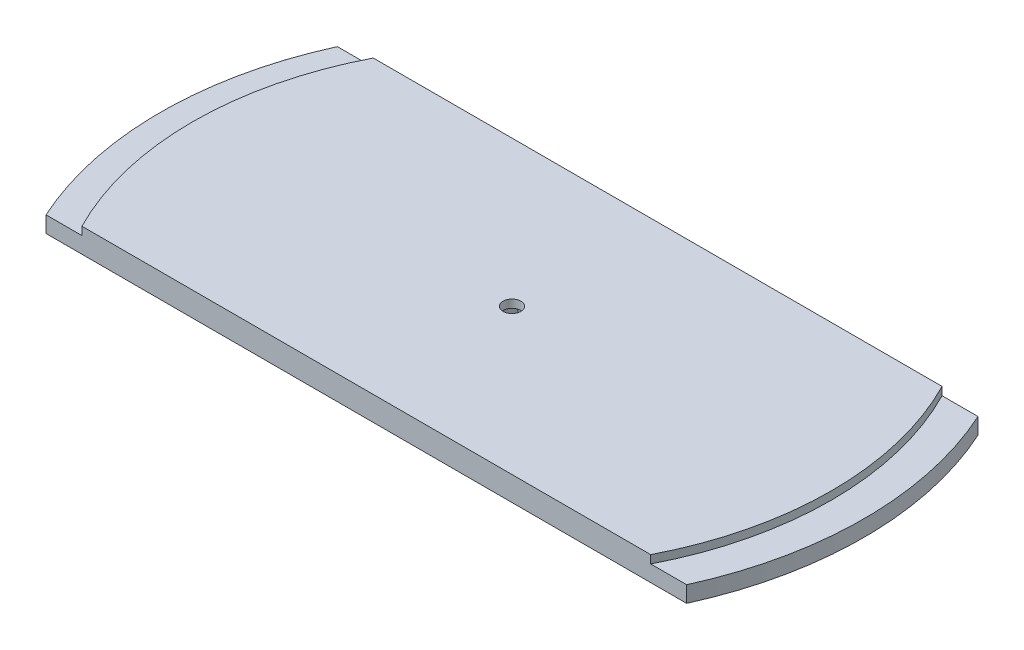
ISO-10303-21;
HEADER;
FILE_DESCRIPTION(('STEP AP214'),'2;1');
FILE_NAME('part.step','',(''),(''),'','','');
FILE_SCHEMA(('AUTOMOTIVE_DESIGN { 1 0 10303 214 1 1 1 1 }'));
ENDSEC;
DATA;
#1=APPLICATION_CONTEXT('core data for automotive mechanical design processes');
#2=APPLICATION_PROTOCOL_DEFINITION('international standard','automotive_design',2000,#1);
#3=PRODUCT_CONTEXT('',#1,'mechanical');
#4=PRODUCT('Part','Part','',(#3));
#5=PRODUCT_RELATED_PRODUCT_CATEGORY('part','',(#4));
#6=PRODUCT_DEFINITION_FORMATION('','',#4);
#7=PRODUCT_DEFINITION_CONTEXT('part definition',#1,'design');
#8=PRODUCT_DEFINITION('design','',#6,#7);
#9=PRODUCT_DEFINITION_SHAPE('','',#8);
#10=(LENGTH_UNIT() NAMED_UNIT(*) SI_UNIT(.MILLI.,.METRE.));
#11=(NAMED_UNIT(*) PLANE_ANGLE_UNIT() SI_UNIT($,.RADIAN.));
#12=(NAMED_UNIT(*) SI_UNIT($,.STERADIAN.) SOLID_ANGLE_UNIT());
#13=UNCERTAINTY_MEASURE_WITH_UNIT(LENGTH_MEASURE(1.E-05),#10,'distance_accuracy_value','');
#14=(GEOMETRIC_REPRESENTATION_CONTEXT(3) GLOBAL_UNCERTAINTY_ASSIGNED_CONTEXT((#13)) GLOBAL_UNIT_ASSIGNED_CONTEXT((#10,
#11,#12)) REPRESENTATION_CONTEXT('',''));
#15=CARTESIAN_POINT('',(0.,0.,0.));
#16=DIRECTION('',(0.,0.,1.));
#17=DIRECTION('',(1.,0.,0.));
#18=AXIS2_PLACEMENT_3D('',#15,#16,#17);
#19=CARTESIAN_POINT('',(-4.94933518262807,9.525,-2.8575));
#20=DIRECTION('',(0.866025403784439,0.,0.5));
#21=DIRECTION('',(0.5,0.,-0.866025403784438));
#22=AXIS2_PLACEMENT_3D('',#19,#20,#21);
#23=PLANE('',#22);
#24=DIRECTION('',(0.,-1.,0.));
#25=VECTOR('',#24,1.);
#26=CARTESIAN_POINT('',(-3.29955678841871,9.525,-5.71500000000001));
#27=LINE('',#26,#25);
#28=CARTESIAN_POINT('',(-3.29955678841871,6.35,-5.71500000000001));
#29=VERTEX_POINT('',#28);
#30=CARTESIAN_POINT('',(-3.29955678841871,0.,-5.71500000000001));
#31=VERTEX_POINT('',#30);
#32=EDGE_CURVE('E48',#29,#31,#27,.T.);
#33=ORIENTED_EDGE('',*,*,#32,.F.);
#34=DIRECTION('',(-0.5,0.,0.866025403784439));
#35=VECTOR('',#34,1.);
#36=CARTESIAN_POINT('',(-4.94933518262807,6.35,-2.8575));
#37=LINE('',#36,#35);
#38=CARTESIAN_POINT('',(-6.59911357683742,6.35,0.));
#39=VERTEX_POINT('',#38);
#40=EDGE_CURVE('E145',#29,#39,#37,.T.);
#41=ORIENTED_EDGE('',*,*,#40,.T.);
#42=DIRECTION('',(0.,-1.,0.));
#43=VECTOR('',#42,1.);
#44=CARTESIAN_POINT('',(-6.59911357683742,9.525,0.));
#45=LINE('',#44,#43);
#46=CARTESIAN_POINT('',(-6.59911357683742,0.,0.));
#47=VERTEX_POINT('',#46);
#48=EDGE_CURVE('E186',#39,#47,#45,.T.);
#49=ORIENTED_EDGE('',*,*,#48,.T.);
#50=DIRECTION('',(-0.5,0.,0.866025403784439));
#51=VECTOR('',#50,1.);
#52=CARTESIAN_POINT('',(-4.94933518262807,0.,-2.8575));
#53=LINE('',#52,#51);
#54=EDGE_CURVE('E166',#31,#47,#53,.T.);
#55=ORIENTED_EDGE('',*,*,#54,.F.);
#56=EDGE_LOOP('',(#33,#41,#49,#55));
#57=FACE_BOUND('',#56,.T.);
#58=ADVANCED_FACE('F45',(#57),#23,.T.);
#59=CARTESIAN_POINT('',(0.,9.525,-5.715));
#60=DIRECTION('',(0.,0.,1.));
#61=DIRECTION('',(1.,0.,0.));
#62=AXIS2_PLACEMENT_3D('',#59,#60,#61);
#63=PLANE('',#62);
#64=DIRECTION('',(0.,-1.,0.));
#65=VECTOR('',#64,1.);
#66=CARTESIAN_POINT('',(3.2995567884187,9.525,-5.715));
#67=LINE('',#66,#65);
#68=CARTESIAN_POINT('',(3.2995567884187,6.35,-5.715));
#69=VERTEX_POINT('',#68);
#70=CARTESIAN_POINT('',(3.2995567884187,0.,-5.715));
#71=VERTEX_POINT('',#70);
#72=EDGE_CURVE('E161',#69,#71,#67,.T.);
#73=ORIENTED_EDGE('',*,*,#72,.F.);
#74=DIRECTION('',(-1.,0.,0.));
#75=VECTOR('',#74,1.);
#76=CARTESIAN_POINT('',(0.,6.35,-5.715));
#77=LINE('',#76,#75);
#78=EDGE_CURVE('E148',#69,#29,#77,.T.);
#79=ORIENTED_EDGE('',*,*,#78,.T.);
#80=ORIENTED_EDGE('',*,*,#32,.T.);
#81=DIRECTION('',(-1.,0.,0.));
#82=VECTOR('',#81,1.);
#83=CARTESIAN_POINT('',(0.,0.,-5.715));
#84=LINE('',#83,#82);
#85=EDGE_CURVE('E218',#71,#31,#84,.T.);
#86=ORIENTED_EDGE('',*,*,#85,.F.);
#87=EDGE_LOOP('',(#73,#79,#80,#86));
#88=FACE_BOUND('',#87,.T.);
#89=ADVANCED_FACE('F158',(#88),#63,.T.);
#90=CARTESIAN_POINT('',(4.94933518262806,9.525,-2.8575));
#91=DIRECTION('',(-0.866025403784438,0.,0.5));
#92=DIRECTION('',(0.5,0.,0.866025403784439));
#93=AXIS2_PLACEMENT_3D('',#90,#91,#92);
#94=PLANE('',#93);
#95=DIRECTION('',(0.,-1.,0.));
#96=VECTOR('',#95,1.);
#97=CARTESIAN_POINT('',(6.59911357683742,9.525,0.));
#98=LINE('',#97,#96);
#99=CARTESIAN_POINT('',(6.59911357683742,6.35,0.));
#100=VERTEX_POINT('',#99);
#101=CARTESIAN_POINT('',(6.59911357683742,0.,0.));
#102=VERTEX_POINT('',#101);
#103=EDGE_CURVE('E174',#100,#102,#98,.T.);
#104=ORIENTED_EDGE('',*,*,#103,.F.);
#105=DIRECTION('',(-0.5,0.,-0.866025403784439));
#106=VECTOR('',#105,1.);
#107=CARTESIAN_POINT('',(4.94933518262806,6.35,-2.8575));
#108=LINE('',#107,#106);
#109=EDGE_CURVE('E286',#100,#69,#108,.T.);
#110=ORIENTED_EDGE('',*,*,#109,.T.);
#111=ORIENTED_EDGE('',*,*,#72,.T.);
#112=DIRECTION('',(-0.5,0.,-0.866025403784439));
#113=VECTOR('',#112,1.);
#114=CARTESIAN_POINT('',(4.94933518262806,0.,-2.8575));
#115=LINE('',#114,#113);
#116=EDGE_CURVE('E214',#102,#71,#115,.T.);
#117=ORIENTED_EDGE('',*,*,#116,.F.);
#118=EDGE_LOOP('',(#104,#110,#111,#117));
#119=FACE_BOUND('',#118,.T.);
#120=ADVANCED_FACE('F327',(#119),#94,.T.);
#121=CARTESIAN_POINT('',(4.94933518262806,9.525,2.8575));
#122=DIRECTION('',(-0.866025403784439,0.,-0.5));
#123=DIRECTION('',(-0.5,0.,0.866025403784439));
#124=AXIS2_PLACEMENT_3D('',#121,#122,#123);
#125=PLANE('',#124);
#126=DIRECTION('',(0.,-1.,0.));
#127=VECTOR('',#126,1.);
#128=CARTESIAN_POINT('',(3.29955678841871,9.525,5.715));
#129=LINE('',#128,#127);
#130=CARTESIAN_POINT('',(3.29955678841871,6.35,5.715));
#131=VERTEX_POINT('',#130);
#132=CARTESIAN_POINT('',(3.29955678841871,0.,5.715));
#133=VERTEX_POINT('',#132);
#134=EDGE_CURVE('E178',#131,#133,#129,.T.);
#135=ORIENTED_EDGE('',*,*,#134,.F.);
#136=DIRECTION('',(0.5,0.,-0.866025403784439));
#137=VECTOR('',#136,1.);
#138=CARTESIAN_POINT('',(4.94933518262806,6.35,2.8575));
#139=LINE('',#138,#137);
#140=EDGE_CURVE('E289',#131,#100,#139,.T.);
#141=ORIENTED_EDGE('',*,*,#140,.T.);
#142=ORIENTED_EDGE('',*,*,#103,.T.);
#143=DIRECTION('',(0.5,0.,-0.866025403784439));
#144=VECTOR('',#143,1.);
#145=CARTESIAN_POINT('',(4.94933518262806,0.,2.8575));
#146=LINE('',#145,#144);
#147=EDGE_CURVE('E210',#133,#102,#146,.T.);
#148=ORIENTED_EDGE('',*,*,#147,.F.);
#149=EDGE_LOOP('',(#135,#141,#142,#148));
#150=FACE_BOUND('',#149,.T.);
#151=ADVANCED_FACE('F331',(#150),#125,.T.);
#152=CARTESIAN_POINT('',(0.,9.525,5.715));
#153=DIRECTION('',(0.,0.,-1.));
#154=DIRECTION('',(-1.,0.,0.));
#155=AXIS2_PLACEMENT_3D('',#152,#153,#154);
#156=PLANE('',#155);
#157=DIRECTION('',(0.,-1.,0.));
#158=VECTOR('',#157,1.);
#159=CARTESIAN_POINT('',(-3.29955678841872,9.525,5.715));
#160=LINE('',#159,#158);
#161=CARTESIAN_POINT('',(-3.29955678841872,6.35,5.715));
#162=VERTEX_POINT('',#161);
#163=CARTESIAN_POINT('',(-3.29955678841872,0.,5.715));
#164=VERTEX_POINT('',#163);
#165=EDGE_CURVE('E183',#162,#164,#160,.T.);
#166=ORIENTED_EDGE('',*,*,#165,.F.);
#167=DIRECTION('',(1.,0.,0.));
#168=VECTOR('',#167,1.);
#169=CARTESIAN_POINT('',(0.,6.35,5.715));
#170=LINE('',#169,#168);
#171=EDGE_CURVE('E62',#162,#131,#170,.T.);
#172=ORIENTED_EDGE('',*,*,#171,.T.);
#173=ORIENTED_EDGE('',*,*,#134,.T.);
#174=DIRECTION('',(1.,0.,0.));
#175=VECTOR('',#174,1.);
#176=CARTESIAN_POINT('',(0.,0.,5.715));
#177=LINE('',#176,#175);
#178=EDGE_CURVE('E206',#164,#133,#177,.T.);
#179=ORIENTED_EDGE('',*,*,#178,.F.);
#180=EDGE_LOOP('',(#166,#172,#173,#179));
#181=FACE_BOUND('',#180,.T.);
#182=ADVANCED_FACE('F336',(#181),#156,.T.);
#183=CARTESIAN_POINT('',(-4.94933518262807,9.525,2.8575));
#184=DIRECTION('',(0.866025403784439,0.,-0.5));
#185=DIRECTION('',(-0.5,0.,-0.866025403784439));
#186=AXIS2_PLACEMENT_3D('',#183,#184,#185);
#187=PLANE('',#186);
#188=ORIENTED_EDGE('',*,*,#48,.F.);
#189=DIRECTION('',(0.5,0.,0.866025403784439));
#190=VECTOR('',#189,1.);
#191=CARTESIAN_POINT('',(-4.94933518262807,6.35,2.8575));
#192=LINE('',#191,#190);
#193=EDGE_CURVE('E150',#39,#162,#192,.T.);
#194=ORIENTED_EDGE('',*,*,#193,.T.);
#195=ORIENTED_EDGE('',*,*,#165,.T.);
#196=DIRECTION('',(0.5,0.,0.866025403784439));
#197=VECTOR('',#196,1.);
#198=CARTESIAN_POINT('',(-4.94933518262807,0.,2.8575));
#199=LINE('',#198,#197);
#200=EDGE_CURVE('E202',#47,#164,#199,.T.);
#201=ORIENTED_EDGE('',*,*,#200,.F.);
#202=EDGE_LOOP('',(#188,#194,#195,#201));
#203=FACE_BOUND('',#202,.T.);
#204=ADVANCED_FACE('F340',(#203),#187,.T.);
#205=CARTESIAN_POINT('',(0.,9.525,57.15));
#206=DIRECTION('',(0.,0.,-1.));
#207=DIRECTION('',(-1.,0.,0.));
#208=AXIS2_PLACEMENT_3D('',#205,#206,#207);
#209=PLANE('',#208);
#210=DIRECTION('',(1.,0.,0.));
#211=VECTOR('',#210,1.);
#212=CARTESIAN_POINT('',(0.,0.,57.15));
#213=LINE('',#212,#211);
#214=CARTESIAN_POINT('',(-125.66385280183,0.,57.15));
#215=VERTEX_POINT('',#214);
#216=CARTESIAN_POINT('',(125.66385280183,0.,57.15));
#217=VERTEX_POINT('',#216);
#218=EDGE_CURVE('E199',#215,#217,#213,.T.);
#219=ORIENTED_EDGE('',*,*,#218,.T.);
#220=DIRECTION('',(0.,-1.,0.));
#221=VECTOR('',#220,1.);
#222=CARTESIAN_POINT('',(125.66385280183,6.35,57.15));
#223=LINE('',#222,#221);
#224=CARTESIAN_POINT('',(125.66385280183,6.35,57.15));
#225=VERTEX_POINT('',#224);
#226=EDGE_CURVE('E223',#225,#217,#223,.T.);
#227=ORIENTED_EDGE('',*,*,#226,.F.);
#228=DIRECTION('',(1.,0.,0.));
#229=VECTOR('',#228,1.);
#230=CARTESIAN_POINT('',(0.,6.35,57.15));
#231=LINE('',#230,#229);
#232=CARTESIAN_POINT('',(111.562759471967,6.35,57.15));
#233=VERTEX_POINT('',#232);
#234=EDGE_CURVE('E256',#233,#225,#231,.T.);
#235=ORIENTED_EDGE('',*,*,#234,.F.);
#236=DIRECTION('',(0.,-1.,0.));
#237=VECTOR('',#236,1.);
#238=CARTESIAN_POINT('',(111.562759471967,9.525,57.15));
#239=LINE('',#238,#237);
#240=CARTESIAN_POINT('',(111.562759471967,9.525,57.15));
#241=VERTEX_POINT('',#240);
#242=EDGE_CURVE('E11',#241,#233,#239,.T.);
#243=ORIENTED_EDGE('',*,*,#242,.F.);
#244=DIRECTION('',(1.,0.,0.));
#245=VECTOR('',#244,1.);
#246=CARTESIAN_POINT('',(0.,9.525,57.15));
#247=LINE('',#246,#245);
#248=CARTESIAN_POINT('',(-111.562759471967,9.525,57.15));
#249=VERTEX_POINT('',#248);
#250=EDGE_CURVE('E198',#249,#241,#247,.T.);
#251=ORIENTED_EDGE('',*,*,#250,.F.);
#252=DIRECTION('',(0.,-1.,0.));
#253=VECTOR('',#252,1.);
#254=CARTESIAN_POINT('',(-111.562759471967,9.525,57.15));
#255=LINE('',#254,#253);
#256=CARTESIAN_POINT('',(-111.562759471967,6.35,57.15));
#257=VERTEX_POINT('',#256);
#258=EDGE_CURVE('E169',#249,#257,#255,.T.);
#259=ORIENTED_EDGE('',*,*,#258,.T.);
#260=DIRECTION('',(1.,0.,0.));
#261=VECTOR('',#260,1.);
#262=CARTESIAN_POINT('',(0.,6.35,57.15));
#263=LINE('',#262,#261);
#264=CARTESIAN_POINT('',(-125.66385280183,6.35,57.15));
#265=VERTEX_POINT('',#264);
#266=EDGE_CURVE('E277',#265,#257,#263,.T.);
#267=ORIENTED_EDGE('',*,*,#266,.F.);
#268=DIRECTION('',(0.,-1.,0.));
#269=VECTOR('',#268,1.);
#270=CARTESIAN_POINT('',(-125.66385280183,6.35,57.15));
#271=LINE('',#270,#269);
#272=EDGE_CURVE('E264',#265,#215,#271,.T.);
#273=ORIENTED_EDGE('',*,*,#272,.T.);
#274=EDGE_LOOP('',(#219,#227,#235,#243,#251,#259,#267,#273));
#275=FACE_BOUND('',#274,.T.);
#276=ADVANCED_FACE('F344',(#275),#209,.F.);
#277=CARTESIAN_POINT('',(0.,9.525,0.));
#278=DIRECTION('',(0.,-1.,0.));
#279=DIRECTION('',(0.,0.,-1.));
#280=AXIS2_PLACEMENT_3D('',#277,#278,#279);
#281=CYLINDRICAL_SURFACE('',#280,125.349);
#282=ORIENTED_EDGE('',*,*,#242,.T.);
#283=CARTESIAN_POINT('',(0.,6.35,0.));
#284=DIRECTION('',(0.,1.,0.));
#285=DIRECTION('',(0.,0.,1.));
#286=AXIS2_PLACEMENT_3D('',#283,#284,#285);
#287=CIRCLE('',#286,125.349);
#288=CARTESIAN_POINT('',(111.562759471967,6.35,-57.15));
#289=VERTEX_POINT('',#288);
#290=EDGE_CURVE('E248',#233,#289,#287,.T.);
#291=ORIENTED_EDGE('',*,*,#290,.T.);
#292=DIRECTION('',(0.,-1.,0.));
#293=VECTOR('',#292,1.);
#294=CARTESIAN_POINT('',(111.562759471967,9.525,-57.15));
#295=LINE('',#294,#293);
#296=CARTESIAN_POINT('',(111.562759471967,9.525,-57.15));
#297=VERTEX_POINT('',#296);
#298=EDGE_CURVE('E54',#297,#289,#295,.T.);
#299=ORIENTED_EDGE('',*,*,#298,.F.);
#300=CARTESIAN_POINT('',(0.,9.525,0.));
#301=DIRECTION('',(0.,1.,0.));
#302=DIRECTION('',(0.,0.,1.));
#303=AXIS2_PLACEMENT_3D('',#300,#301,#302);
#304=CIRCLE('',#303,125.349);
#305=EDGE_CURVE('E230',#241,#297,#304,.T.);
#306=ORIENTED_EDGE('',*,*,#305,.F.);
#307=EDGE_LOOP('',(#282,#291,#299,#306));
#308=FACE_BOUND('',#307,.T.);
#309=ADVANCED_FACE('F348',(#308),#281,.T.);
#310=CARTESIAN_POINT('',(0.,9.525,-57.15));
#311=DIRECTION('',(0.,0.,-1.));
#312=DIRECTION('',(-1.,0.,0.));
#313=AXIS2_PLACEMENT_3D('',#310,#311,#312);
#314=PLANE('',#313);
#315=DIRECTION('',(1.,0.,0.));
#316=VECTOR('',#315,1.);
#317=CARTESIAN_POINT('',(0.,0.,-57.15));
#318=LINE('',#317,#316);
#319=CARTESIAN_POINT('',(-125.66385280183,0.,-57.15));
#320=VERTEX_POINT('',#319);
#321=CARTESIAN_POINT('',(125.66385280183,0.,-57.15));
#322=VERTEX_POINT('',#321);
#323=EDGE_CURVE('E195',#320,#322,#318,.T.);
#324=ORIENTED_EDGE('',*,*,#323,.F.);
#325=DIRECTION('',(0.,-1.,0.));
#326=VECTOR('',#325,1.);
#327=CARTESIAN_POINT('',(-125.66385280183,6.35,-57.15));
#328=LINE('',#327,#326);
#329=CARTESIAN_POINT('',(-125.66385280183,6.35,-57.15));
#330=VERTEX_POINT('',#329);
#331=EDGE_CURVE('E249',#330,#320,#328,.T.);
#332=ORIENTED_EDGE('',*,*,#331,.F.);
#333=DIRECTION('',(1.,0.,0.));
#334=VECTOR('',#333,1.);
#335=CARTESIAN_POINT('',(0.,6.35,-57.15));
#336=LINE('',#335,#334);
#337=CARTESIAN_POINT('',(-111.562759471967,6.35,-57.15));
#338=VERTEX_POINT('',#337);
#339=EDGE_CURVE('E273',#330,#338,#336,.T.);
#340=ORIENTED_EDGE('',*,*,#339,.T.);
#341=DIRECTION('',(0.,-1.,0.));
#342=VECTOR('',#341,1.);
#343=CARTESIAN_POINT('',(-111.562759471967,9.525,-57.15));
#344=LINE('',#343,#342);
#345=CARTESIAN_POINT('',(-111.562759471967,9.525,-57.15));
#346=VERTEX_POINT('',#345);
#347=EDGE_CURVE('E70',#346,#338,#344,.T.);
#348=ORIENTED_EDGE('',*,*,#347,.F.);
#349=DIRECTION('',(1.,0.,0.));
#350=VECTOR('',#349,1.);
#351=CARTESIAN_POINT('',(0.,9.525,-57.15));
#352=LINE('',#351,#350);
#353=EDGE_CURVE('E226',#346,#297,#352,.T.);
#354=ORIENTED_EDGE('',*,*,#353,.T.);
#355=ORIENTED_EDGE('',*,*,#298,.T.);
#356=DIRECTION('',(1.,0.,0.));
#357=VECTOR('',#356,1.);
#358=CARTESIAN_POINT('',(0.,6.35,-57.15));
#359=LINE('',#358,#357);
#360=CARTESIAN_POINT('',(125.66385280183,6.35,-57.15));
#361=VERTEX_POINT('',#360);
#362=EDGE_CURVE('E243',#289,#361,#359,.T.);
#363=ORIENTED_EDGE('',*,*,#362,.T.);
#364=DIRECTION('',(0.,-1.,0.));
#365=VECTOR('',#364,1.);
#366=CARTESIAN_POINT('',(125.66385280183,6.35,-57.15));
#367=LINE('',#366,#365);
#368=EDGE_CURVE('E239',#361,#322,#367,.T.);
#369=ORIENTED_EDGE('',*,*,#368,.T.);
#370=EDGE_LOOP('',(#324,#332,#340,#348,#354,#355,#363,#369));
#371=FACE_BOUND('',#370,.T.);
#372=ADVANCED_FACE('F320',(#371),#314,.T.);
#373=CARTESIAN_POINT('',(0.,9.525,0.));
#374=DIRECTION('',(0.,-1.,0.));
#375=DIRECTION('',(0.,0.,-1.));
#376=AXIS2_PLACEMENT_3D('',#373,#374,#375);
#377=CYLINDRICAL_SURFACE('',#376,125.349);
#378=ORIENTED_EDGE('',*,*,#347,.T.);
#379=CARTESIAN_POINT('',(0.,6.35,0.));
#380=DIRECTION('',(0.,1.,0.));
#381=DIRECTION('',(0.,0.,1.));
#382=AXIS2_PLACEMENT_3D('',#379,#380,#381);
#383=CIRCLE('',#382,125.349);
#384=EDGE_CURVE('E268',#338,#257,#383,.T.);
#385=ORIENTED_EDGE('',*,*,#384,.T.);
#386=ORIENTED_EDGE('',*,*,#258,.F.);
#387=CARTESIAN_POINT('',(0.,9.525,0.));
#388=DIRECTION('',(0.,1.,0.));
#389=DIRECTION('',(0.,0.,1.));
#390=AXIS2_PLACEMENT_3D('',#387,#388,#389);
#391=CIRCLE('',#390,125.349);
#392=EDGE_CURVE('E188',#346,#249,#391,.T.);
#393=ORIENTED_EDGE('',*,*,#392,.F.);
#394=EDGE_LOOP('',(#378,#385,#386,#393));
#395=FACE_BOUND('',#394,.T.);
#396=ADVANCED_FACE('F310',(#395),#377,.T.);
#397=CARTESIAN_POINT('',(0.,9.525,0.));
#398=DIRECTION('',(0.,1.,0.));
#399=DIRECTION('',(0.,0.,1.));
#400=AXIS2_PLACEMENT_3D('',#397,#398,#399);
#401=PLANE('',#400);
#402=ORIENTED_EDGE('',*,*,#250,.T.);
#403=ORIENTED_EDGE('',*,*,#305,.T.);
#404=ORIENTED_EDGE('',*,*,#353,.F.);
#405=ORIENTED_EDGE('',*,*,#392,.T.);
#406=EDGE_LOOP('',(#402,#403,#404,#405));
#407=FACE_BOUND('',#406,.T.);
#408=CARTESIAN_POINT('',(0.,9.525,0.));
#409=DIRECTION('',(0.,1.,0.));
#410=DIRECTION('',(0.,0.,1.));
#411=AXIS2_PLACEMENT_3D('',#408,#409,#410);
#412=CIRCLE('',#411,3.4925);
#413=CARTESIAN_POINT('',(0.,9.525,3.4925));
#414=VERTEX_POINT('',#413);
#415=EDGE_CURVE('E274',#414,#414,#412,.T.);
#416=ORIENTED_EDGE('',*,*,#415,.F.);
#417=EDGE_LOOP('',(#416));
#418=FACE_BOUND('',#417,.T.);
#419=ADVANCED_FACE('F307',(#407,#418),#401,.T.);
#420=CARTESIAN_POINT('',(0.,0.,0.));
#421=DIRECTION('',(0.,1.,0.));
#422=DIRECTION('',(0.,0.,1.));
#423=AXIS2_PLACEMENT_3D('',#420,#421,#422);
#424=PLANE('',#423);
#425=ORIENTED_EDGE('',*,*,#54,.T.);
#426=ORIENTED_EDGE('',*,*,#200,.T.);
#427=ORIENTED_EDGE('',*,*,#178,.T.);
#428=ORIENTED_EDGE('',*,*,#147,.T.);
#429=ORIENTED_EDGE('',*,*,#116,.T.);
#430=ORIENTED_EDGE('',*,*,#85,.T.);
#431=EDGE_LOOP('',(#425,#426,#427,#428,#429,#430));
#432=FACE_BOUND('',#431,.T.);
#433=ORIENTED_EDGE('',*,*,#218,.F.);
#434=CARTESIAN_POINT('',(0.,0.,0.));
#435=DIRECTION('',(0.,1.,0.));
#436=DIRECTION('',(0.,0.,1.));
#437=AXIS2_PLACEMENT_3D('',#434,#435,#436);
#438=CIRCLE('',#437,138.049);
#439=EDGE_CURVE('E269',#320,#215,#438,.T.);
#440=ORIENTED_EDGE('',*,*,#439,.F.);
#441=ORIENTED_EDGE('',*,*,#323,.T.);
#442=CARTESIAN_POINT('',(0.,0.,0.));
#443=DIRECTION('',(0.,1.,0.));
#444=DIRECTION('',(0.,0.,1.));
#445=AXIS2_PLACEMENT_3D('',#442,#443,#444);
#446=CIRCLE('',#445,138.049);
#447=EDGE_CURVE('E244',#217,#322,#446,.T.);
#448=ORIENTED_EDGE('',*,*,#447,.F.);
#449=EDGE_LOOP('',(#433,#440,#441,#448));
#450=FACE_BOUND('',#449,.T.);
#451=ADVANCED_FACE('F309',(#432,#450),#424,.F.);
#452=CARTESIAN_POINT('',(0.,6.35,0.));
#453=DIRECTION('',(0.,-1.,0.));
#454=DIRECTION('',(0.,0.,-1.));
#455=AXIS2_PLACEMENT_3D('',#452,#453,#454);
#456=CYLINDRICAL_SURFACE('',#455,138.049);
#457=ORIENTED_EDGE('',*,*,#447,.T.);
#458=ORIENTED_EDGE('',*,*,#368,.F.);
#459=CARTESIAN_POINT('',(0.,6.35,0.));
#460=DIRECTION('',(0.,1.,0.));
#461=DIRECTION('',(0.,0.,1.));
#462=AXIS2_PLACEMENT_3D('',#459,#460,#461);
#463=CIRCLE('',#462,138.049);
#464=EDGE_CURVE('E253',#225,#361,#463,.T.);
#465=ORIENTED_EDGE('',*,*,#464,.F.);
#466=ORIENTED_EDGE('',*,*,#226,.T.);
#467=EDGE_LOOP('',(#457,#458,#465,#466));
#468=FACE_BOUND('',#467,.T.);
#469=ADVANCED_FACE('F317',(#468),#456,.T.);
#470=CARTESIAN_POINT('',(0.,6.35,0.));
#471=DIRECTION('',(0.,1.,0.));
#472=DIRECTION('',(0.,0.,1.));
#473=AXIS2_PLACEMENT_3D('',#470,#471,#472);
#474=PLANE('',#473);
#475=ORIENTED_EDGE('',*,*,#290,.F.);
#476=ORIENTED_EDGE('',*,*,#234,.T.);
#477=ORIENTED_EDGE('',*,*,#464,.T.);
#478=ORIENTED_EDGE('',*,*,#362,.F.);
#479=EDGE_LOOP('',(#475,#476,#477,#478));
#480=FACE_BOUND('',#479,.T.);
#481=ADVANCED_FACE('F374',(#480),#474,.T.);
#482=CARTESIAN_POINT('',(0.,6.35,0.));
#483=DIRECTION('',(0.,-1.,0.));
#484=DIRECTION('',(0.,0.,-1.));
#485=AXIS2_PLACEMENT_3D('',#482,#483,#484);
#486=CYLINDRICAL_SURFACE('',#485,138.049);
#487=ORIENTED_EDGE('',*,*,#439,.T.);
#488=ORIENTED_EDGE('',*,*,#272,.F.);
#489=CARTESIAN_POINT('',(0.,6.35,0.));
#490=DIRECTION('',(0.,1.,0.));
#491=DIRECTION('',(0.,0.,1.));
#492=AXIS2_PLACEMENT_3D('',#489,#490,#491);
#493=CIRCLE('',#492,138.049);
#494=EDGE_CURVE('E281',#330,#265,#493,.T.);
#495=ORIENTED_EDGE('',*,*,#494,.F.);
#496=ORIENTED_EDGE('',*,*,#331,.T.);
#497=EDGE_LOOP('',(#487,#488,#495,#496));
#498=FACE_BOUND('',#497,.T.);
#499=ADVANCED_FACE('F363',(#498),#486,.T.);
#500=CARTESIAN_POINT('',(0.,6.35,0.));
#501=DIRECTION('',(0.,1.,0.));
#502=DIRECTION('',(0.,0.,1.));
#503=AXIS2_PLACEMENT_3D('',#500,#501,#502);
#504=PLANE('',#503);
#505=ORIENTED_EDGE('',*,*,#339,.F.);
#506=ORIENTED_EDGE('',*,*,#494,.T.);
#507=ORIENTED_EDGE('',*,*,#266,.T.);
#508=ORIENTED_EDGE('',*,*,#384,.F.);
#509=EDGE_LOOP('',(#505,#506,#507,#508));
#510=FACE_BOUND('',#509,.T.);
#511=ADVANCED_FACE('F382',(#510),#504,.T.);
#512=CARTESIAN_POINT('',(0.,9.525,0.));
#513=DIRECTION('',(0.,-1.,0.));
#514=DIRECTION('',(0.,0.,-1.));
#515=AXIS2_PLACEMENT_3D('',#512,#513,#514);
#516=CYLINDRICAL_SURFACE('',#515,3.4925);
#517=ORIENTED_EDGE('',*,*,#415,.T.);
#518=EDGE_LOOP('',(#517));
#519=FACE_BOUND('',#518,.T.);
#520=CARTESIAN_POINT('',(0.,6.35,0.));
#521=DIRECTION('',(0.,1.,0.));
#522=DIRECTION('',(0.,0.,1.));
#523=AXIS2_PLACEMENT_3D('',#520,#521,#522);
#524=CIRCLE('',#523,3.4925);
#525=CARTESIAN_POINT('',(0.,6.35,3.4925));
#526=VERTEX_POINT('',#525);
#527=EDGE_CURVE('E163',#526,#526,#524,.T.);
#528=ORIENTED_EDGE('',*,*,#527,.F.);
#529=EDGE_LOOP('',(#528));
#530=FACE_BOUND('',#529,.T.);
#531=ADVANCED_FACE('F304',(#519,#530),#516,.F.);
#532=CARTESIAN_POINT('',(0.,6.35,0.));
#533=DIRECTION('',(0.,1.,0.));
#534=DIRECTION('',(0.,0.,1.));
#535=AXIS2_PLACEMENT_3D('',#532,#533,#534);
#536=PLANE('',#535);
#537=ORIENTED_EDGE('',*,*,#527,.T.);
#538=EDGE_LOOP('',(#537));
#539=FACE_BOUND('',#538,.T.);
#540=ORIENTED_EDGE('',*,*,#78,.F.);
#541=ORIENTED_EDGE('',*,*,#109,.F.);
#542=ORIENTED_EDGE('',*,*,#140,.F.);
#543=ORIENTED_EDGE('',*,*,#171,.F.);
#544=ORIENTED_EDGE('',*,*,#193,.F.);
#545=ORIENTED_EDGE('',*,*,#40,.F.);
#546=EDGE_LOOP('',(#540,#541,#542,#543,#544,#545));
#547=FACE_BOUND('',#546,.T.);
#548=ADVANCED_FACE('F147',(#539,#547),#536,.F.);
#549=CLOSED_SHELL('',(#58,#89,#120,#151,#182,#204,#276,#309,#372,#396,#419,#451,#469,#481,#499,
#511,#531,#548));
#550=MANIFOLD_SOLID_BREP('B2',#549);
#551=ADVANCED_BREP_SHAPE_REPRESENTATION('',(#18,#550),#14);
#552=SHAPE_DEFINITION_REPRESENTATION(#9,#551);
ENDSEC;
END-ISO-10303-21;
